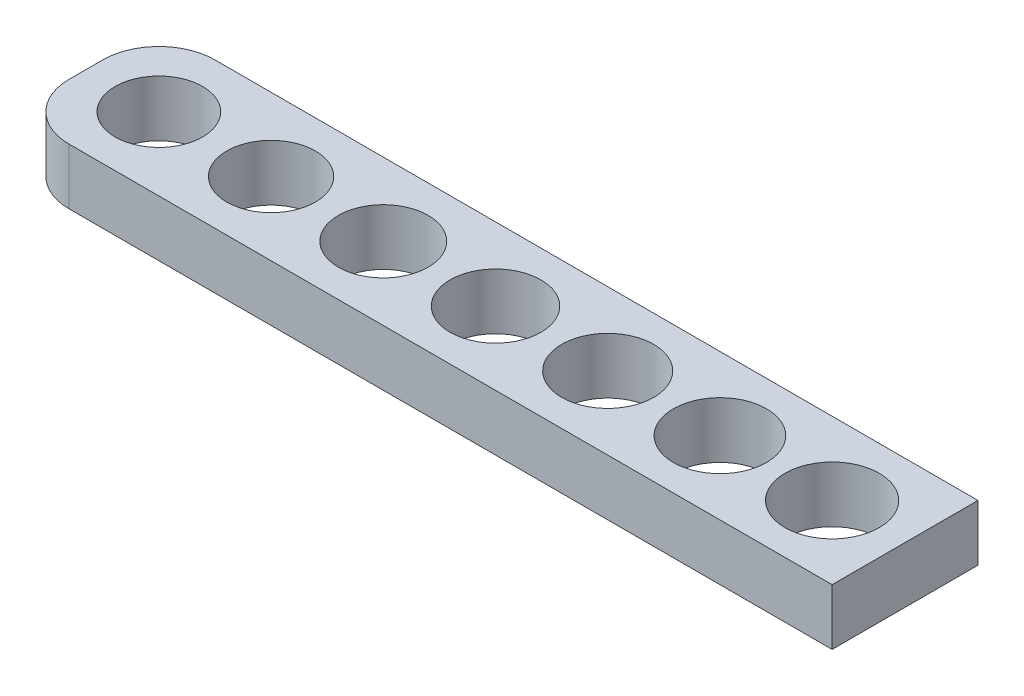
ISO-10303-21;
HEADER;
FILE_DESCRIPTION(('STEP AP214'),'2;1');
FILE_NAME('part.step','',(''),(''),'','','');
FILE_SCHEMA(('AUTOMOTIVE_DESIGN { 1 0 10303 214 1 1 1 1 }'));
ENDSEC;
DATA;
#1=APPLICATION_CONTEXT('core data for automotive mechanical design processes');
#2=APPLICATION_PROTOCOL_DEFINITION('international standard','automotive_design',2000,#1);
#3=PRODUCT_CONTEXT('',#1,'mechanical');
#4=PRODUCT('Part','Part','',(#3));
#5=PRODUCT_RELATED_PRODUCT_CATEGORY('part','',(#4));
#6=PRODUCT_DEFINITION_FORMATION('','',#4);
#7=PRODUCT_DEFINITION_CONTEXT('part definition',#1,'design');
#8=PRODUCT_DEFINITION('design','',#6,#7);
#9=PRODUCT_DEFINITION_SHAPE('','',#8);
#10=(LENGTH_UNIT() NAMED_UNIT(*) SI_UNIT(.MILLI.,.METRE.));
#11=(NAMED_UNIT(*) PLANE_ANGLE_UNIT() SI_UNIT($,.RADIAN.));
#12=(NAMED_UNIT(*) SI_UNIT($,.STERADIAN.) SOLID_ANGLE_UNIT());
#13=UNCERTAINTY_MEASURE_WITH_UNIT(LENGTH_MEASURE(1.E-05),#10,'distance_accuracy_value','');
#14=(GEOMETRIC_REPRESENTATION_CONTEXT(3) GLOBAL_UNCERTAINTY_ASSIGNED_CONTEXT((#13)) GLOBAL_UNIT_ASSIGNED_CONTEXT((#10,
#11,#12)) REPRESENTATION_CONTEXT('',''));
#15=CARTESIAN_POINT('',(0.,0.,0.));
#16=DIRECTION('',(0.,0.,1.));
#17=DIRECTION('',(1.,0.,0.));
#18=AXIS2_PLACEMENT_3D('',#15,#16,#17);
#19=CARTESIAN_POINT('',(0.,5.,0.));
#20=DIRECTION('',(0.,-1.,0.));
#21=DIRECTION('',(0.,0.,-1.));
#22=AXIS2_PLACEMENT_3D('',#19,#20,#21);
#23=PLANE('',#22);
#24=DIRECTION('',(-1.,0.,0.));
#25=VECTOR('',#24,1.);
#26=CARTESIAN_POINT('',(-6.5,5.,-6.5));
#27=LINE('',#26,#25);
#28=CARTESIAN_POINT('',(66.5,5.,-6.5));
#29=VERTEX_POINT('',#28);
#30=CARTESIAN_POINT('',(-1.5,5.,-6.5));
#31=VERTEX_POINT('',#30);
#32=EDGE_CURVE('E108',#29,#31,#27,.T.);
#33=ORIENTED_EDGE('',*,*,#32,.T.);
#34=CARTESIAN_POINT('',(-1.5,5.,-1.5));
#35=DIRECTION('',(0.,-1.,0.));
#36=DIRECTION('',(0.,0.,-1.));
#37=AXIS2_PLACEMENT_3D('',#34,#35,#36);
#38=CIRCLE('',#37,5.);
#39=CARTESIAN_POINT('',(-6.5,5.,-1.5));
#40=VERTEX_POINT('',#39);
#41=EDGE_CURVE('E41',#31,#40,#38,.F.);
#42=ORIENTED_EDGE('',*,*,#41,.T.);
#43=DIRECTION('',(0.,0.,1.));
#44=VECTOR('',#43,1.);
#45=CARTESIAN_POINT('',(-6.5,5.,6.5));
#46=LINE('',#45,#44);
#47=CARTESIAN_POINT('',(-6.5,5.,1.5));
#48=VERTEX_POINT('',#47);
#49=EDGE_CURVE('E94',#40,#48,#46,.T.);
#50=ORIENTED_EDGE('',*,*,#49,.T.);
#51=CARTESIAN_POINT('',(-1.5,5.,1.5));
#52=DIRECTION('',(0.,-1.,0.));
#53=DIRECTION('',(0.,0.,-1.));
#54=AXIS2_PLACEMENT_3D('',#51,#52,#53);
#55=CIRCLE('',#54,5.);
#56=CARTESIAN_POINT('',(-1.5,5.,6.5));
#57=VERTEX_POINT('',#56);
#58=EDGE_CURVE('E48',#48,#57,#55,.F.);
#59=ORIENTED_EDGE('',*,*,#58,.T.);
#60=DIRECTION('',(1.,0.,0.));
#61=VECTOR('',#60,1.);
#62=CARTESIAN_POINT('',(-6.5,5.,6.5));
#63=LINE('',#62,#61);
#64=CARTESIAN_POINT('',(66.5,5.,6.5));
#65=VERTEX_POINT('',#64);
#66=EDGE_CURVE('E86',#57,#65,#63,.T.);
#67=ORIENTED_EDGE('',*,*,#66,.T.);
#68=DIRECTION('',(0.,0.,-1.));
#69=VECTOR('',#68,1.);
#70=CARTESIAN_POINT('',(66.5,5.,6.5));
#71=LINE('',#70,#69);
#72=EDGE_CURVE('E90',#65,#29,#71,.T.);
#73=ORIENTED_EDGE('',*,*,#72,.T.);
#74=EDGE_LOOP('',(#33,#42,#50,#59,#67,#73));
#75=FACE_BOUND('',#74,.T.);
#76=CARTESIAN_POINT('',(0.,5.,0.));
#77=DIRECTION('',(0.,1.,0.));
#78=DIRECTION('',(0.,0.,1.));
#79=AXIS2_PLACEMENT_3D('',#76,#77,#78);
#80=CIRCLE('',#79,3.9);
#81=CARTESIAN_POINT('',(0.,5.,3.9));
#82=VERTEX_POINT('',#81);
#83=EDGE_CURVE('E116',#82,#82,#80,.T.);
#84=ORIENTED_EDGE('',*,*,#83,.F.);
#85=EDGE_LOOP('',(#84));
#86=FACE_BOUND('',#85,.T.);
#87=CARTESIAN_POINT('',(10.,5.,0.));
#88=DIRECTION('',(0.,1.,0.));
#89=DIRECTION('',(0.,0.,1.));
#90=AXIS2_PLACEMENT_3D('',#87,#88,#89);
#91=CIRCLE('',#90,3.95);
#92=CARTESIAN_POINT('',(10.,5.,3.95));
#93=VERTEX_POINT('',#92);
#94=EDGE_CURVE('E226',#93,#93,#91,.T.);
#95=ORIENTED_EDGE('',*,*,#94,.F.);
#96=EDGE_LOOP('',(#95));
#97=FACE_BOUND('',#96,.T.);
#98=CARTESIAN_POINT('',(20.,5.,0.));
#99=DIRECTION('',(0.,1.,0.));
#100=DIRECTION('',(0.,0.,1.));
#101=AXIS2_PLACEMENT_3D('',#98,#99,#100);
#102=CIRCLE('',#101,4.);
#103=CARTESIAN_POINT('',(20.,5.,4.));
#104=VERTEX_POINT('',#103);
#105=EDGE_CURVE('E220',#104,#104,#102,.T.);
#106=ORIENTED_EDGE('',*,*,#105,.F.);
#107=EDGE_LOOP('',(#106));
#108=FACE_BOUND('',#107,.T.);
#109=CARTESIAN_POINT('',(30.,5.,0.));
#110=DIRECTION('',(0.,1.,0.));
#111=DIRECTION('',(0.,0.,1.));
#112=AXIS2_PLACEMENT_3D('',#109,#110,#111);
#113=CIRCLE('',#112,4.05);
#114=CARTESIAN_POINT('',(30.,5.,4.05));
#115=VERTEX_POINT('',#114);
#116=EDGE_CURVE('E214',#115,#115,#113,.T.);
#117=ORIENTED_EDGE('',*,*,#116,.F.);
#118=EDGE_LOOP('',(#117));
#119=FACE_BOUND('',#118,.T.);
#120=CARTESIAN_POINT('',(40.,5.,0.));
#121=DIRECTION('',(0.,1.,0.));
#122=DIRECTION('',(0.,0.,1.));
#123=AXIS2_PLACEMENT_3D('',#120,#121,#122);
#124=CIRCLE('',#123,4.1);
#125=CARTESIAN_POINT('',(40.,5.,4.1));
#126=VERTEX_POINT('',#125);
#127=EDGE_CURVE('E208',#126,#126,#124,.T.);
#128=ORIENTED_EDGE('',*,*,#127,.F.);
#129=EDGE_LOOP('',(#128));
#130=FACE_BOUND('',#129,.T.);
#131=CARTESIAN_POINT('',(50.,5.,0.));
#132=DIRECTION('',(0.,1.,0.));
#133=DIRECTION('',(0.,0.,1.));
#134=AXIS2_PLACEMENT_3D('',#131,#132,#133);
#135=CIRCLE('',#134,4.15);
#136=CARTESIAN_POINT('',(50.,5.,4.15));
#137=VERTEX_POINT('',#136);
#138=EDGE_CURVE('E202',#137,#137,#135,.T.);
#139=ORIENTED_EDGE('',*,*,#138,.F.);
#140=EDGE_LOOP('',(#139));
#141=FACE_BOUND('',#140,.T.);
#142=CARTESIAN_POINT('',(60.,5.,0.));
#143=DIRECTION('',(0.,1.,0.));
#144=DIRECTION('',(0.,0.,1.));
#145=AXIS2_PLACEMENT_3D('',#142,#143,#144);
#146=CIRCLE('',#145,4.2);
#147=CARTESIAN_POINT('',(60.,5.,4.2));
#148=VERTEX_POINT('',#147);
#149=EDGE_CURVE('E193',#148,#148,#146,.T.);
#150=ORIENTED_EDGE('',*,*,#149,.F.);
#151=EDGE_LOOP('',(#150));
#152=FACE_BOUND('',#151,.T.);
#153=ADVANCED_FACE('F33',(#75,#86,#97,#108,#119,#130,#141,#152),#23,.F.);
#154=CARTESIAN_POINT('',(0.,0.,0.));
#155=DIRECTION('',(0.,-1.,0.));
#156=DIRECTION('',(0.,0.,-1.));
#157=AXIS2_PLACEMENT_3D('',#154,#155,#156);
#158=PLANE('',#157);
#159=CARTESIAN_POINT('',(50.,0.,0.));
#160=DIRECTION('',(0.,1.,0.));
#161=DIRECTION('',(0.,0.,1.));
#162=AXIS2_PLACEMENT_3D('',#159,#160,#161);
#163=CIRCLE('',#162,4.15);
#164=CARTESIAN_POINT('',(50.,0.,4.15));
#165=VERTEX_POINT('',#164);
#166=EDGE_CURVE('E199',#165,#165,#163,.T.);
#167=ORIENTED_EDGE('',*,*,#166,.T.);
#168=EDGE_LOOP('',(#167));
#169=FACE_BOUND('',#168,.T.);
#170=CARTESIAN_POINT('',(30.,0.,0.));
#171=DIRECTION('',(0.,1.,0.));
#172=DIRECTION('',(0.,0.,1.));
#173=AXIS2_PLACEMENT_3D('',#170,#171,#172);
#174=CIRCLE('',#173,4.05);
#175=CARTESIAN_POINT('',(30.,0.,4.05));
#176=VERTEX_POINT('',#175);
#177=EDGE_CURVE('E211',#176,#176,#174,.T.);
#178=ORIENTED_EDGE('',*,*,#177,.T.);
#179=EDGE_LOOP('',(#178));
#180=FACE_BOUND('',#179,.T.);
#181=CARTESIAN_POINT('',(10.,0.,0.));
#182=DIRECTION('',(0.,1.,0.));
#183=DIRECTION('',(0.,0.,1.));
#184=AXIS2_PLACEMENT_3D('',#181,#182,#183);
#185=CIRCLE('',#184,3.95);
#186=CARTESIAN_POINT('',(10.,0.,3.95));
#187=VERTEX_POINT('',#186);
#188=EDGE_CURVE('E223',#187,#187,#185,.T.);
#189=ORIENTED_EDGE('',*,*,#188,.T.);
#190=EDGE_LOOP('',(#189));
#191=FACE_BOUND('',#190,.T.);
#192=DIRECTION('',(0.,0.,1.));
#193=VECTOR('',#192,1.);
#194=CARTESIAN_POINT('',(-6.5,0.,6.5));
#195=LINE('',#194,#193);
#196=CARTESIAN_POINT('',(-6.5,0.,-1.5));
#197=VERTEX_POINT('',#196);
#198=CARTESIAN_POINT('',(-6.5,0.,1.5));
#199=VERTEX_POINT('',#198);
#200=EDGE_CURVE('E113',#197,#199,#195,.T.);
#201=ORIENTED_EDGE('',*,*,#200,.F.);
#202=CARTESIAN_POINT('',(-1.5,0.,-1.5));
#203=DIRECTION('',(0.,-1.,0.));
#204=DIRECTION('',(0.,0.,-1.));
#205=AXIS2_PLACEMENT_3D('',#202,#203,#204);
#206=CIRCLE('',#205,5.);
#207=CARTESIAN_POINT('',(-1.5,0.,-6.5));
#208=VERTEX_POINT('',#207);
#209=EDGE_CURVE('E129',#197,#208,#206,.T.);
#210=ORIENTED_EDGE('',*,*,#209,.T.);
#211=DIRECTION('',(-1.,0.,0.));
#212=VECTOR('',#211,1.);
#213=CARTESIAN_POINT('',(-6.5,0.,-6.5));
#214=LINE('',#213,#212);
#215=CARTESIAN_POINT('',(66.5,0.,-6.5));
#216=VERTEX_POINT('',#215);
#217=EDGE_CURVE('E120',#216,#208,#214,.T.);
#218=ORIENTED_EDGE('',*,*,#217,.F.);
#219=DIRECTION('',(0.,0.,-1.));
#220=VECTOR('',#219,1.);
#221=CARTESIAN_POINT('',(66.5,0.,6.5));
#222=LINE('',#221,#220);
#223=CARTESIAN_POINT('',(66.5,0.,6.5));
#224=VERTEX_POINT('',#223);
#225=EDGE_CURVE('E118',#224,#216,#222,.T.);
#226=ORIENTED_EDGE('',*,*,#225,.F.);
#227=DIRECTION('',(1.,0.,0.));
#228=VECTOR('',#227,1.);
#229=CARTESIAN_POINT('',(-6.5,0.,6.5));
#230=LINE('',#229,#228);
#231=CARTESIAN_POINT('',(-1.5,0.,6.5));
#232=VERTEX_POINT('',#231);
#233=EDGE_CURVE('E100',#232,#224,#230,.T.);
#234=ORIENTED_EDGE('',*,*,#233,.F.);
#235=CARTESIAN_POINT('',(-1.5,0.,1.5));
#236=DIRECTION('',(0.,-1.,0.));
#237=DIRECTION('',(0.,0.,-1.));
#238=AXIS2_PLACEMENT_3D('',#235,#236,#237);
#239=CIRCLE('',#238,5.);
#240=EDGE_CURVE('E127',#232,#199,#239,.T.);
#241=ORIENTED_EDGE('',*,*,#240,.T.);
#242=EDGE_LOOP('',(#201,#210,#218,#226,#234,#241));
#243=FACE_BOUND('',#242,.T.);
#244=CARTESIAN_POINT('',(0.,0.,0.));
#245=DIRECTION('',(0.,1.,0.));
#246=DIRECTION('',(0.,0.,1.));
#247=AXIS2_PLACEMENT_3D('',#244,#245,#246);
#248=CIRCLE('',#247,3.9);
#249=CARTESIAN_POINT('',(0.,0.,3.9));
#250=VERTEX_POINT('',#249);
#251=EDGE_CURVE('E229',#250,#250,#248,.T.);
#252=ORIENTED_EDGE('',*,*,#251,.T.);
#253=EDGE_LOOP('',(#252));
#254=FACE_BOUND('',#253,.T.);
#255=CARTESIAN_POINT('',(20.,0.,0.));
#256=DIRECTION('',(0.,1.,0.));
#257=DIRECTION('',(0.,0.,1.));
#258=AXIS2_PLACEMENT_3D('',#255,#256,#257);
#259=CIRCLE('',#258,4.);
#260=CARTESIAN_POINT('',(20.,0.,4.));
#261=VERTEX_POINT('',#260);
#262=EDGE_CURVE('E217',#261,#261,#259,.T.);
#263=ORIENTED_EDGE('',*,*,#262,.T.);
#264=EDGE_LOOP('',(#263));
#265=FACE_BOUND('',#264,.T.);
#266=CARTESIAN_POINT('',(40.,0.,0.));
#267=DIRECTION('',(0.,1.,0.));
#268=DIRECTION('',(0.,0.,1.));
#269=AXIS2_PLACEMENT_3D('',#266,#267,#268);
#270=CIRCLE('',#269,4.1);
#271=CARTESIAN_POINT('',(40.,0.,4.1));
#272=VERTEX_POINT('',#271);
#273=EDGE_CURVE('E205',#272,#272,#270,.T.);
#274=ORIENTED_EDGE('',*,*,#273,.T.);
#275=EDGE_LOOP('',(#274));
#276=FACE_BOUND('',#275,.T.);
#277=CARTESIAN_POINT('',(60.,0.,0.));
#278=DIRECTION('',(0.,1.,0.));
#279=DIRECTION('',(0.,0.,1.));
#280=AXIS2_PLACEMENT_3D('',#277,#278,#279);
#281=CIRCLE('',#280,4.2);
#282=CARTESIAN_POINT('',(60.,0.,4.2));
#283=VERTEX_POINT('',#282);
#284=EDGE_CURVE('E196',#283,#283,#281,.T.);
#285=ORIENTED_EDGE('',*,*,#284,.T.);
#286=EDGE_LOOP('',(#285));
#287=FACE_BOUND('',#286,.T.);
#288=ADVANCED_FACE('F143',(#169,#180,#191,#243,#254,#265,#276,#287),#158,.T.);
#289=CARTESIAN_POINT('',(-6.5,5.,6.5));
#290=DIRECTION('',(1.,0.,0.));
#291=DIRECTION('',(0.,0.,-1.));
#292=AXIS2_PLACEMENT_3D('',#289,#290,#291);
#293=PLANE('',#292);
#294=ORIENTED_EDGE('',*,*,#49,.F.);
#295=DIRECTION('',(0.,-1.,0.));
#296=VECTOR('',#295,1.);
#297=CARTESIAN_POINT('',(-6.5,5.,-1.5));
#298=LINE('',#297,#296);
#299=EDGE_CURVE('E124',#40,#197,#298,.T.);
#300=ORIENTED_EDGE('',*,*,#299,.T.);
#301=ORIENTED_EDGE('',*,*,#200,.T.);
#302=DIRECTION('',(0.,-1.,0.));
#303=VECTOR('',#302,1.);
#304=CARTESIAN_POINT('',(-6.5,5.,1.5));
#305=LINE('',#304,#303);
#306=EDGE_CURVE('E103',#199,#48,#305,.F.);
#307=ORIENTED_EDGE('',*,*,#306,.T.);
#308=EDGE_LOOP('',(#294,#300,#301,#307));
#309=FACE_BOUND('',#308,.T.);
#310=ADVANCED_FACE('F137',(#309),#293,.F.);
#311=CARTESIAN_POINT('',(-6.5,5.,6.5));
#312=DIRECTION('',(0.,0.,-1.));
#313=DIRECTION('',(-1.,0.,0.));
#314=AXIS2_PLACEMENT_3D('',#311,#312,#313);
#315=PLANE('',#314);
#316=ORIENTED_EDGE('',*,*,#66,.F.);
#317=DIRECTION('',(0.,-1.,0.));
#318=VECTOR('',#317,1.);
#319=CARTESIAN_POINT('',(-1.5,5.,6.5));
#320=LINE('',#319,#318);
#321=EDGE_CURVE('E11',#57,#232,#320,.T.);
#322=ORIENTED_EDGE('',*,*,#321,.T.);
#323=ORIENTED_EDGE('',*,*,#233,.T.);
#324=DIRECTION('',(0.,-1.,0.));
#325=VECTOR('',#324,1.);
#326=CARTESIAN_POINT('',(66.5,5.,6.5));
#327=LINE('',#326,#325);
#328=EDGE_CURVE('E97',#65,#224,#327,.T.);
#329=ORIENTED_EDGE('',*,*,#328,.F.);
#330=EDGE_LOOP('',(#316,#322,#323,#329));
#331=FACE_BOUND('',#330,.T.);
#332=ADVANCED_FACE('F98',(#331),#315,.F.);
#333=CARTESIAN_POINT('',(66.5,5.,6.5));
#334=DIRECTION('',(-1.,0.,0.));
#335=DIRECTION('',(0.,0.,1.));
#336=AXIS2_PLACEMENT_3D('',#333,#334,#335);
#337=PLANE('',#336);
#338=ORIENTED_EDGE('',*,*,#225,.T.);
#339=DIRECTION('',(0.,-1.,0.));
#340=VECTOR('',#339,1.);
#341=CARTESIAN_POINT('',(66.5,5.,-6.5));
#342=LINE('',#341,#340);
#343=EDGE_CURVE('E104',#29,#216,#342,.T.);
#344=ORIENTED_EDGE('',*,*,#343,.F.);
#345=ORIENTED_EDGE('',*,*,#72,.F.);
#346=ORIENTED_EDGE('',*,*,#328,.T.);
#347=EDGE_LOOP('',(#338,#344,#345,#346));
#348=FACE_BOUND('',#347,.T.);
#349=ADVANCED_FACE('F106',(#348),#337,.F.);
#350=CARTESIAN_POINT('',(-6.5,5.,-6.5));
#351=DIRECTION('',(0.,0.,1.));
#352=DIRECTION('',(1.,0.,0.));
#353=AXIS2_PLACEMENT_3D('',#350,#351,#352);
#354=PLANE('',#353);
#355=ORIENTED_EDGE('',*,*,#217,.T.);
#356=DIRECTION('',(0.,-1.,0.));
#357=VECTOR('',#356,1.);
#358=CARTESIAN_POINT('',(-1.5,5.,-6.5));
#359=LINE('',#358,#357);
#360=EDGE_CURVE('E56',#208,#31,#359,.F.);
#361=ORIENTED_EDGE('',*,*,#360,.T.);
#362=ORIENTED_EDGE('',*,*,#32,.F.);
#363=ORIENTED_EDGE('',*,*,#343,.T.);
#364=EDGE_LOOP('',(#355,#361,#362,#363));
#365=FACE_BOUND('',#364,.T.);
#366=ADVANCED_FACE('F145',(#365),#354,.F.);
#367=CARTESIAN_POINT('',(0.,5.,0.));
#368=DIRECTION('',(0.,-1.,0.));
#369=DIRECTION('',(0.,0.,-1.));
#370=AXIS2_PLACEMENT_3D('',#367,#368,#369);
#371=CYLINDRICAL_SURFACE('',#370,3.9);
#372=ORIENTED_EDGE('',*,*,#83,.T.);
#373=EDGE_LOOP('',(#372));
#374=FACE_BOUND('',#373,.T.);
#375=ORIENTED_EDGE('',*,*,#251,.F.);
#376=EDGE_LOOP('',(#375));
#377=FACE_BOUND('',#376,.T.);
#378=ADVANCED_FACE('F147',(#374,#377),#371,.F.);
#379=CARTESIAN_POINT('',(10.,5.,0.));
#380=DIRECTION('',(0.,-1.,0.));
#381=DIRECTION('',(0.,0.,-1.));
#382=AXIS2_PLACEMENT_3D('',#379,#380,#381);
#383=CYLINDRICAL_SURFACE('',#382,3.95);
#384=ORIENTED_EDGE('',*,*,#94,.T.);
#385=EDGE_LOOP('',(#384));
#386=FACE_BOUND('',#385,.T.);
#387=ORIENTED_EDGE('',*,*,#188,.F.);
#388=EDGE_LOOP('',(#387));
#389=FACE_BOUND('',#388,.T.);
#390=ADVANCED_FACE('F153',(#386,#389),#383,.F.);
#391=CARTESIAN_POINT('',(20.,5.,0.));
#392=DIRECTION('',(0.,-1.,0.));
#393=DIRECTION('',(0.,0.,-1.));
#394=AXIS2_PLACEMENT_3D('',#391,#392,#393);
#395=CYLINDRICAL_SURFACE('',#394,4.);
#396=ORIENTED_EDGE('',*,*,#105,.T.);
#397=EDGE_LOOP('',(#396));
#398=FACE_BOUND('',#397,.T.);
#399=ORIENTED_EDGE('',*,*,#262,.F.);
#400=EDGE_LOOP('',(#399));
#401=FACE_BOUND('',#400,.T.);
#402=ADVANCED_FACE('F167',(#398,#401),#395,.F.);
#403=CARTESIAN_POINT('',(30.,5.,0.));
#404=DIRECTION('',(0.,-1.,0.));
#405=DIRECTION('',(0.,0.,-1.));
#406=AXIS2_PLACEMENT_3D('',#403,#404,#405);
#407=CYLINDRICAL_SURFACE('',#406,4.05);
#408=ORIENTED_EDGE('',*,*,#116,.T.);
#409=EDGE_LOOP('',(#408));
#410=FACE_BOUND('',#409,.T.);
#411=ORIENTED_EDGE('',*,*,#177,.F.);
#412=EDGE_LOOP('',(#411));
#413=FACE_BOUND('',#412,.T.);
#414=ADVANCED_FACE('F171',(#410,#413),#407,.F.);
#415=CARTESIAN_POINT('',(40.,5.,0.));
#416=DIRECTION('',(0.,-1.,0.));
#417=DIRECTION('',(0.,0.,-1.));
#418=AXIS2_PLACEMENT_3D('',#415,#416,#417);
#419=CYLINDRICAL_SURFACE('',#418,4.1);
#420=ORIENTED_EDGE('',*,*,#127,.T.);
#421=EDGE_LOOP('',(#420));
#422=FACE_BOUND('',#421,.T.);
#423=ORIENTED_EDGE('',*,*,#273,.F.);
#424=EDGE_LOOP('',(#423));
#425=FACE_BOUND('',#424,.T.);
#426=ADVANCED_FACE('F175',(#422,#425),#419,.F.);
#427=CARTESIAN_POINT('',(50.,5.,0.));
#428=DIRECTION('',(0.,-1.,0.));
#429=DIRECTION('',(0.,0.,-1.));
#430=AXIS2_PLACEMENT_3D('',#427,#428,#429);
#431=CYLINDRICAL_SURFACE('',#430,4.15);
#432=ORIENTED_EDGE('',*,*,#138,.T.);
#433=EDGE_LOOP('',(#432));
#434=FACE_BOUND('',#433,.T.);
#435=ORIENTED_EDGE('',*,*,#166,.F.);
#436=EDGE_LOOP('',(#435));
#437=FACE_BOUND('',#436,.T.);
#438=ADVANCED_FACE('F179',(#434,#437),#431,.F.);
#439=CARTESIAN_POINT('',(60.,5.,0.));
#440=DIRECTION('',(0.,-1.,0.));
#441=DIRECTION('',(0.,0.,-1.));
#442=AXIS2_PLACEMENT_3D('',#439,#440,#441);
#443=CYLINDRICAL_SURFACE('',#442,4.2);
#444=ORIENTED_EDGE('',*,*,#149,.T.);
#445=EDGE_LOOP('',(#444));
#446=FACE_BOUND('',#445,.T.);
#447=ORIENTED_EDGE('',*,*,#284,.F.);
#448=EDGE_LOOP('',(#447));
#449=FACE_BOUND('',#448,.T.);
#450=ADVANCED_FACE('F183',(#446,#449),#443,.F.);
#451=CARTESIAN_POINT('',(-1.5,5.,-1.5));
#452=DIRECTION('',(0.,-1.,0.));
#453=DIRECTION('',(0.,0.,-1.));
#454=AXIS2_PLACEMENT_3D('',#451,#452,#453);
#455=CYLINDRICAL_SURFACE('',#454,5.);
#456=ORIENTED_EDGE('',*,*,#41,.F.);
#457=ORIENTED_EDGE('',*,*,#360,.F.);
#458=ORIENTED_EDGE('',*,*,#209,.F.);
#459=ORIENTED_EDGE('',*,*,#299,.F.);
#460=EDGE_LOOP('',(#456,#457,#458,#459));
#461=FACE_BOUND('',#460,.T.);
#462=ADVANCED_FACE('F140',(#461),#455,.T.);
#463=CARTESIAN_POINT('',(-1.5,5.,1.5));
#464=DIRECTION('',(0.,-1.,0.));
#465=DIRECTION('',(0.,0.,-1.));
#466=AXIS2_PLACEMENT_3D('',#463,#464,#465);
#467=CYLINDRICAL_SURFACE('',#466,5.);
#468=ORIENTED_EDGE('',*,*,#58,.F.);
#469=ORIENTED_EDGE('',*,*,#306,.F.);
#470=ORIENTED_EDGE('',*,*,#240,.F.);
#471=ORIENTED_EDGE('',*,*,#321,.F.);
#472=EDGE_LOOP('',(#468,#469,#470,#471));
#473=FACE_BOUND('',#472,.T.);
#474=ADVANCED_FACE('F35',(#473),#467,.T.);
#475=CLOSED_SHELL('',(#153,#288,#310,#332,#349,#366,#378,#390,#402,#414,#426,#438,#450,#462,#474));
#476=MANIFOLD_SOLID_BREP('B2',#475);
#477=ADVANCED_BREP_SHAPE_REPRESENTATION('',(#18,#476),#14);
#478=SHAPE_DEFINITION_REPRESENTATION(#9,#477);
ENDSEC;
END-ISO-10303-21;
